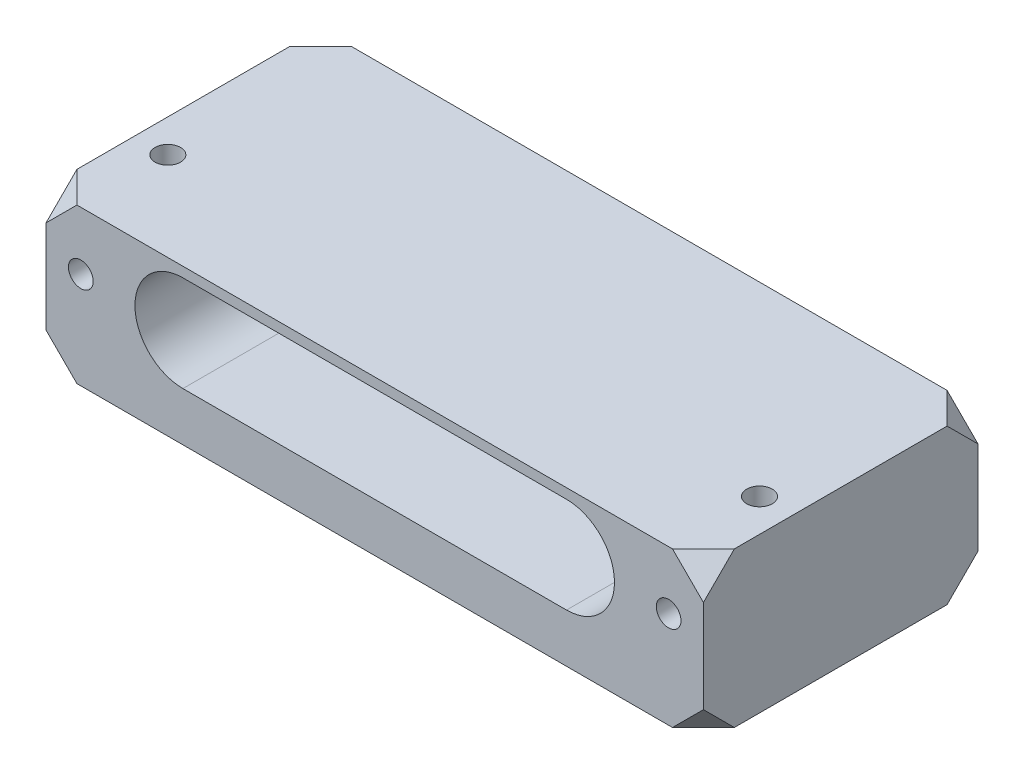
ISO-10303-21;
HEADER;
FILE_DESCRIPTION(('STEP AP214'),'2;1');
FILE_NAME('part.step','',(''),(''),'','','');
FILE_SCHEMA(('AUTOMOTIVE_DESIGN { 1 0 10303 214 1 1 1 1 }'));
ENDSEC;
DATA;
#1=APPLICATION_CONTEXT('core data for automotive mechanical design processes');
#2=APPLICATION_PROTOCOL_DEFINITION('international standard','automotive_design',2000,#1);
#3=PRODUCT_CONTEXT('',#1,'mechanical');
#4=PRODUCT('Part','Part','',(#3));
#5=PRODUCT_RELATED_PRODUCT_CATEGORY('part','',(#4));
#6=PRODUCT_DEFINITION_FORMATION('','',#4);
#7=PRODUCT_DEFINITION_CONTEXT('part definition',#1,'design');
#8=PRODUCT_DEFINITION('design','',#6,#7);
#9=PRODUCT_DEFINITION_SHAPE('','',#8);
#10=(LENGTH_UNIT() NAMED_UNIT(*) SI_UNIT(.MILLI.,.METRE.));
#11=(NAMED_UNIT(*) PLANE_ANGLE_UNIT() SI_UNIT($,.RADIAN.));
#12=(NAMED_UNIT(*) SI_UNIT($,.STERADIAN.) SOLID_ANGLE_UNIT());
#13=UNCERTAINTY_MEASURE_WITH_UNIT(LENGTH_MEASURE(1.E-05),#10,'distance_accuracy_value','');
#14=(GEOMETRIC_REPRESENTATION_CONTEXT(3) GLOBAL_UNCERTAINTY_ASSIGNED_CONTEXT((#13)) GLOBAL_UNIT_ASSIGNED_CONTEXT((#10,
#11,#12)) REPRESENTATION_CONTEXT('',''));
#15=CARTESIAN_POINT('',(0.,0.,0.));
#16=DIRECTION('',(0.,0.,1.));
#17=DIRECTION('',(1.,0.,0.));
#18=AXIS2_PLACEMENT_3D('',#15,#16,#17);
#19=CARTESIAN_POINT('',(0.,105.914201387198,-35.5));
#20=DIRECTION('',(0.,0.,-1.));
#21=DIRECTION('',(-1.,0.,0.));
#22=AXIS2_PLACEMENT_3D('',#19,#20,#21);
#23=PLANE('',#22);
#24=DIRECTION('',(-1.,0.,0.));
#25=VECTOR('',#24,1.);
#26=CARTESIAN_POINT('',(0.,20.,-35.5));
#27=LINE('',#26,#25);
#28=CARTESIAN_POINT('',(81.,20.,-35.5));
#29=VERTEX_POINT('',#28);
#30=CARTESIAN_POINT('',(3.99999999999999,20.,-35.5));
#31=VERTEX_POINT('',#30);
#32=EDGE_CURVE('E234',#29,#31,#27,.T.);
#33=ORIENTED_EDGE('',*,*,#32,.F.);
#34=DIRECTION('',(0.707106781186547,-0.707106781186547,0.));
#35=VECTOR('',#34,1.);
#36=CARTESIAN_POINT('',(-2.45710069359897,103.457100693599,-35.5));
#37=LINE('',#36,#35);
#38=CARTESIAN_POINT('',(85.,16.,-35.5));
#39=VERTEX_POINT('',#38);
#40=EDGE_CURVE('E238',#29,#39,#37,.T.);
#41=ORIENTED_EDGE('',*,*,#40,.T.);
#42=DIRECTION('',(0.,-1.,0.));
#43=VECTOR('',#42,1.);
#44=CARTESIAN_POINT('',(85.,105.914201387198,-35.5));
#45=LINE('',#44,#43);
#46=CARTESIAN_POINT('',(85.,4.00000000000004,-35.5));
#47=VERTEX_POINT('',#46);
#48=EDGE_CURVE('E226',#39,#47,#45,.T.);
#49=ORIENTED_EDGE('',*,*,#48,.T.);
#50=DIRECTION('',(-0.707106781186548,-0.707106781186547,0.));
#51=VECTOR('',#50,1.);
#52=CARTESIAN_POINT('',(93.4571006935989,12.457100693599,-35.5));
#53=LINE('',#52,#51);
#54=CARTESIAN_POINT('',(81.,0.,-35.5));
#55=VERTEX_POINT('',#54);
#56=EDGE_CURVE('E252',#47,#55,#53,.T.);
#57=ORIENTED_EDGE('',*,*,#56,.T.);
#58=DIRECTION('',(1.,0.,0.));
#59=VECTOR('',#58,1.);
#60=CARTESIAN_POINT('',(0.,0.,-35.5));
#61=LINE('',#60,#59);
#62=CARTESIAN_POINT('',(4.,0.,-35.5));
#63=VERTEX_POINT('',#62);
#64=EDGE_CURVE('E372',#63,#55,#61,.T.);
#65=ORIENTED_EDGE('',*,*,#64,.F.);
#66=DIRECTION('',(-0.707106781186548,0.707106781186548,0.));
#67=VECTOR('',#66,1.);
#68=CARTESIAN_POINT('',(-50.957100693599,54.957100693599,-35.5));
#69=LINE('',#68,#67);
#70=CARTESIAN_POINT('',(0.,4.00000000000002,-35.5));
#71=VERTEX_POINT('',#70);
#72=EDGE_CURVE('E266',#63,#71,#69,.T.);
#73=ORIENTED_EDGE('',*,*,#72,.T.);
#74=DIRECTION('',(0.,-1.,0.));
#75=VECTOR('',#74,1.);
#76=CARTESIAN_POINT('',(0.,105.914201387198,-35.5));
#77=LINE('',#76,#75);
#78=CARTESIAN_POINT('',(0.,16.,-35.5));
#79=VERTEX_POINT('',#78);
#80=EDGE_CURVE('E235',#79,#71,#77,.T.);
#81=ORIENTED_EDGE('',*,*,#80,.F.);
#82=DIRECTION('',(0.707106781186547,0.707106781186548,0.));
#83=VECTOR('',#82,1.);
#84=CARTESIAN_POINT('',(44.957100693599,60.957100693599,-35.5));
#85=LINE('',#84,#83);
#86=EDGE_CURVE('E263',#79,#31,#85,.T.);
#87=ORIENTED_EDGE('',*,*,#86,.T.);
#88=EDGE_LOOP('',(#33,#41,#49,#57,#65,#73,#81,#87));
#89=FACE_BOUND('',#88,.T.);
#90=ADVANCED_FACE('F45',(#89),#23,.T.);
#91=CARTESIAN_POINT('',(0.,0.,0.));
#92=DIRECTION('',(0.,-1.,0.));
#93=DIRECTION('',(0.,0.,-1.));
#94=AXIS2_PLACEMENT_3D('',#91,#92,#93);
#95=PLANE('',#94);
#96=DIRECTION('',(0.866025403784439,0.,-0.5));
#97=VECTOR('',#96,1.);
#98=CARTESIAN_POINT('',(1.3,0.,-13.2031832941094));
#99=LINE('',#98,#97);
#100=CARTESIAN_POINT('',(1.3,0.,-13.2031832941094));
#101=VERTEX_POINT('',#100);
#102=CARTESIAN_POINT('',(4.25,0.,-14.9063665882188));
#103=VERTEX_POINT('',#102);
#104=EDGE_CURVE('E449',#101,#103,#99,.T.);
#105=ORIENTED_EDGE('',*,*,#104,.F.);
#106=DIRECTION('',(0.,0.,-1.));
#107=VECTOR('',#106,1.);
#108=CARTESIAN_POINT('',(1.3,0.,-9.7968167058906));
#109=LINE('',#108,#107);
#110=CARTESIAN_POINT('',(1.3,0.,-9.7968167058906));
#111=VERTEX_POINT('',#110);
#112=EDGE_CURVE('E507',#111,#101,#109,.T.);
#113=ORIENTED_EDGE('',*,*,#112,.F.);
#114=DIRECTION('',(-0.866025403784438,0.,-0.5));
#115=VECTOR('',#114,1.);
#116=CARTESIAN_POINT('',(4.25,0.,-8.09363341178121));
#117=LINE('',#116,#115);
#118=CARTESIAN_POINT('',(4.25,0.,-8.09363341178121));
#119=VERTEX_POINT('',#118);
#120=EDGE_CURVE('E512',#119,#111,#117,.T.);
#121=ORIENTED_EDGE('',*,*,#120,.F.);
#122=DIRECTION('',(-0.866025403784439,0.,0.5));
#123=VECTOR('',#122,1.);
#124=CARTESIAN_POINT('',(7.2,0.,-9.7968167058906));
#125=LINE('',#124,#123);
#126=CARTESIAN_POINT('',(7.2,0.,-9.7968167058906));
#127=VERTEX_POINT('',#126);
#128=EDGE_CURVE('E516',#127,#119,#125,.T.);
#129=ORIENTED_EDGE('',*,*,#128,.F.);
#130=DIRECTION('',(0.,0.,1.));
#131=VECTOR('',#130,1.);
#132=CARTESIAN_POINT('',(7.2,0.,-13.2031832941094));
#133=LINE('',#132,#131);
#134=CARTESIAN_POINT('',(7.2,0.,-13.2031832941094));
#135=VERTEX_POINT('',#134);
#136=EDGE_CURVE('E520',#135,#127,#133,.T.);
#137=ORIENTED_EDGE('',*,*,#136,.F.);
#138=DIRECTION('',(0.866025403784439,0.,0.5));
#139=VECTOR('',#138,1.);
#140=CARTESIAN_POINT('',(4.25,0.,-14.9063665882188));
#141=LINE('',#140,#139);
#142=EDGE_CURVE('E524',#103,#135,#141,.T.);
#143=ORIENTED_EDGE('',*,*,#142,.F.);
#144=EDGE_LOOP('',(#105,#113,#121,#129,#137,#143));
#145=FACE_BOUND('',#144,.T.);
#146=DIRECTION('',(0.866025403784439,0.,-0.5));
#147=VECTOR('',#146,1.);
#148=CARTESIAN_POINT('',(77.8,0.,-13.2031832941094));
#149=LINE('',#148,#147);
#150=CARTESIAN_POINT('',(77.8,0.,-13.2031832941094));
#151=VERTEX_POINT('',#150);
#152=CARTESIAN_POINT('',(80.75,0.,-14.9063665882188));
#153=VERTEX_POINT('',#152);
#154=EDGE_CURVE('E446',#151,#153,#149,.T.);
#155=ORIENTED_EDGE('',*,*,#154,.F.);
#156=DIRECTION('',(0.,0.,-1.));
#157=VECTOR('',#156,1.);
#158=CARTESIAN_POINT('',(77.8,0.,-9.7968167058906));
#159=LINE('',#158,#157);
#160=CARTESIAN_POINT('',(77.8,0.,-9.7968167058906));
#161=VERTEX_POINT('',#160);
#162=EDGE_CURVE('E424',#161,#151,#159,.T.);
#163=ORIENTED_EDGE('',*,*,#162,.F.);
#164=DIRECTION('',(-0.866025403784439,0.,-0.499999999999999));
#165=VECTOR('',#164,1.);
#166=CARTESIAN_POINT('',(80.75,0.,-8.09363341178121));
#167=LINE('',#166,#165);
#168=CARTESIAN_POINT('',(80.75,0.,-8.09363341178121));
#169=VERTEX_POINT('',#168);
#170=EDGE_CURVE('E462',#169,#161,#167,.T.);
#171=ORIENTED_EDGE('',*,*,#170,.F.);
#172=DIRECTION('',(-0.866025403784438,0.,0.500000000000001));
#173=VECTOR('',#172,1.);
#174=CARTESIAN_POINT('',(83.7,0.,-9.79681670589062));
#175=LINE('',#174,#173);
#176=CARTESIAN_POINT('',(83.7,0.,-9.79681670589062));
#177=VERTEX_POINT('',#176);
#178=EDGE_CURVE('E458',#177,#169,#175,.T.);
#179=ORIENTED_EDGE('',*,*,#178,.F.);
#180=DIRECTION('',(0.,0.,1.));
#181=VECTOR('',#180,1.);
#182=CARTESIAN_POINT('',(83.7,0.,-13.2031832941094));
#183=LINE('',#182,#181);
#184=CARTESIAN_POINT('',(83.7,0.,-13.2031832941094));
#185=VERTEX_POINT('',#184);
#186=EDGE_CURVE('E454',#185,#177,#183,.T.);
#187=ORIENTED_EDGE('',*,*,#186,.F.);
#188=DIRECTION('',(0.866025403784438,0.,0.500000000000001));
#189=VECTOR('',#188,1.);
#190=CARTESIAN_POINT('',(80.75,0.,-14.9063665882188));
#191=LINE('',#190,#189);
#192=EDGE_CURVE('E450',#153,#185,#191,.T.);
#193=ORIENTED_EDGE('',*,*,#192,.F.);
#194=EDGE_LOOP('',(#155,#163,#171,#179,#187,#193));
#195=FACE_BOUND('',#194,.T.);
#196=ORIENTED_EDGE('',*,*,#64,.T.);
#197=DIRECTION('',(0.707106781186548,0.,0.707106781186548));
#198=VECTOR('',#197,1.);
#199=CARTESIAN_POINT('',(58.25,0.,-58.25));
#200=LINE('',#199,#198);
#201=CARTESIAN_POINT('',(85.,0.,-31.5));
#202=VERTEX_POINT('',#201);
#203=EDGE_CURVE('E248',#55,#202,#200,.T.);
#204=ORIENTED_EDGE('',*,*,#203,.T.);
#205=DIRECTION('',(0.,0.,-1.));
#206=VECTOR('',#205,1.);
#207=CARTESIAN_POINT('',(85.,0.,0.));
#208=LINE('',#207,#206);
#209=CARTESIAN_POINT('',(85.,0.,-4.));
#210=VERTEX_POINT('',#209);
#211=EDGE_CURVE('E342',#210,#202,#208,.T.);
#212=ORIENTED_EDGE('',*,*,#211,.F.);
#213=DIRECTION('',(-0.707106781186548,0.,0.707106781186547));
#214=VECTOR('',#213,1.);
#215=CARTESIAN_POINT('',(40.5,0.,40.5));
#216=LINE('',#215,#214);
#217=CARTESIAN_POINT('',(81.,0.,0.));
#218=VERTEX_POINT('',#217);
#219=EDGE_CURVE('E310',#210,#218,#216,.T.);
#220=ORIENTED_EDGE('',*,*,#219,.T.);
#221=DIRECTION('',(1.,0.,0.));
#222=VECTOR('',#221,1.);
#223=CARTESIAN_POINT('',(0.,0.,0.));
#224=LINE('',#223,#222);
#225=CARTESIAN_POINT('',(4.,0.,0.));
#226=VERTEX_POINT('',#225);
#227=EDGE_CURVE('E346',#226,#218,#224,.T.);
#228=ORIENTED_EDGE('',*,*,#227,.F.);
#229=DIRECTION('',(-0.707106781186548,0.,-0.707106781186547));
#230=VECTOR('',#229,1.);
#231=CARTESIAN_POINT('',(2.,0.,-2.));
#232=LINE('',#231,#230);
#233=CARTESIAN_POINT('',(0.,0.,-4.));
#234=VERTEX_POINT('',#233);
#235=EDGE_CURVE('E321',#226,#234,#232,.T.);
#236=ORIENTED_EDGE('',*,*,#235,.T.);
#237=DIRECTION('',(0.,0.,1.));
#238=VECTOR('',#237,1.);
#239=CARTESIAN_POINT('',(0.,0.,0.));
#240=LINE('',#239,#238);
#241=CARTESIAN_POINT('',(0.,0.,-31.5));
#242=VERTEX_POINT('',#241);
#243=EDGE_CURVE('E350',#242,#234,#240,.T.);
#244=ORIENTED_EDGE('',*,*,#243,.F.);
#245=DIRECTION('',(0.707106781186547,0.,-0.707106781186548));
#246=VECTOR('',#245,1.);
#247=CARTESIAN_POINT('',(-15.75,0.,-15.75));
#248=LINE('',#247,#246);
#249=EDGE_CURVE('E274',#242,#63,#248,.T.);
#250=ORIENTED_EDGE('',*,*,#249,.T.);
#251=EDGE_LOOP('',(#196,#204,#212,#220,#228,#236,#244,#250));
#252=FACE_BOUND('',#251,.T.);
#253=ADVANCED_FACE('F611',(#145,#195,#252),#95,.T.);
#254=CARTESIAN_POINT('',(4.25,20.,-11.5));
#255=DIRECTION('',(0.,-1.,0.));
#256=DIRECTION('',(0.,0.,-1.));
#257=AXIS2_PLACEMENT_3D('',#254,#255,#256);
#258=CYLINDRICAL_SURFACE('',#257,1.65);
#259=CARTESIAN_POINT('',(4.25,20.,-11.5));
#260=DIRECTION('',(0.,1.,0.));
#261=DIRECTION('',(0.,0.,1.));
#262=AXIS2_PLACEMENT_3D('',#259,#260,#261);
#263=CIRCLE('',#262,1.65);
#264=CARTESIAN_POINT('',(4.25,20.,-9.85));
#265=VERTEX_POINT('',#264);
#266=EDGE_CURVE('E353',#265,#265,#263,.T.);
#267=ORIENTED_EDGE('',*,*,#266,.T.);
#268=EDGE_LOOP('',(#267));
#269=FACE_BOUND('',#268,.T.);
#270=CARTESIAN_POINT('',(4.25,7.,-11.5));
#271=DIRECTION('',(0.,-1.,0.));
#272=DIRECTION('',(0.,0.,-1.));
#273=AXIS2_PLACEMENT_3D('',#270,#271,#272);
#274=CIRCLE('',#273,1.65);
#275=CARTESIAN_POINT('',(4.25,7.,-13.15));
#276=VERTEX_POINT('',#275);
#277=EDGE_CURVE('E326',#276,#276,#274,.T.);
#278=ORIENTED_EDGE('',*,*,#277,.T.);
#279=EDGE_LOOP('',(#278));
#280=FACE_BOUND('',#279,.T.);
#281=ADVANCED_FACE('F615',(#269,#280),#258,.F.);
#282=CARTESIAN_POINT('',(80.75,20.,-11.5));
#283=DIRECTION('',(0.,-1.,0.));
#284=DIRECTION('',(0.,0.,-1.));
#285=AXIS2_PLACEMENT_3D('',#282,#283,#284);
#286=CYLINDRICAL_SURFACE('',#285,1.65);
#287=CARTESIAN_POINT('',(80.75,20.,-11.5));
#288=DIRECTION('',(0.,1.,0.));
#289=DIRECTION('',(0.,0.,1.));
#290=AXIS2_PLACEMENT_3D('',#287,#288,#289);
#291=CIRCLE('',#290,1.65);
#292=CARTESIAN_POINT('',(80.75,20.,-9.85));
#293=VERTEX_POINT('',#292);
#294=EDGE_CURVE('E365',#293,#293,#291,.T.);
#295=ORIENTED_EDGE('',*,*,#294,.T.);
#296=EDGE_LOOP('',(#295));
#297=FACE_BOUND('',#296,.T.);
#298=CARTESIAN_POINT('',(80.75,7.,-11.5));
#299=DIRECTION('',(0.,-1.,0.));
#300=DIRECTION('',(0.,0.,-1.));
#301=AXIS2_PLACEMENT_3D('',#298,#299,#300);
#302=CIRCLE('',#301,1.65);
#303=CARTESIAN_POINT('',(80.75,7.,-13.15));
#304=VERTEX_POINT('',#303);
#305=EDGE_CURVE('E331',#304,#304,#302,.T.);
#306=ORIENTED_EDGE('',*,*,#305,.T.);
#307=EDGE_LOOP('',(#306));
#308=FACE_BOUND('',#307,.T.);
#309=ADVANCED_FACE('F619',(#297,#308),#286,.F.);
#310=CARTESIAN_POINT('',(0.,20.,0.));
#311=DIRECTION('',(0.,-1.,0.));
#312=DIRECTION('',(0.,0.,-1.));
#313=AXIS2_PLACEMENT_3D('',#310,#311,#312);
#314=PLANE('',#313);
#315=DIRECTION('',(0.707106781186547,0.,0.707106781186547));
#316=VECTOR('',#315,1.);
#317=CARTESIAN_POINT('',(58.25,20.,-58.25));
#318=LINE('',#317,#316);
#319=CARTESIAN_POINT('',(85.,20.,-31.5));
#320=VERTEX_POINT('',#319);
#321=EDGE_CURVE('E54',#29,#320,#318,.T.);
#322=ORIENTED_EDGE('',*,*,#321,.F.);
#323=ORIENTED_EDGE('',*,*,#32,.T.);
#324=DIRECTION('',(0.707106781186547,0.,-0.707106781186548));
#325=VECTOR('',#324,1.);
#326=CARTESIAN_POINT('',(-15.75,20.,-15.75));
#327=LINE('',#326,#325);
#328=CARTESIAN_POINT('',(0.,20.,-31.5));
#329=VERTEX_POINT('',#328);
#330=EDGE_CURVE('E259',#329,#31,#327,.T.);
#331=ORIENTED_EDGE('',*,*,#330,.F.);
#332=DIRECTION('',(0.,0.,1.));
#333=VECTOR('',#332,1.);
#334=CARTESIAN_POINT('',(0.,20.,0.));
#335=LINE('',#334,#333);
#336=CARTESIAN_POINT('',(0.,20.,-4.));
#337=VERTEX_POINT('',#336);
#338=EDGE_CURVE('E345',#329,#337,#335,.T.);
#339=ORIENTED_EDGE('',*,*,#338,.T.);
#340=DIRECTION('',(-0.707106781186548,0.,-0.707106781186547));
#341=VECTOR('',#340,1.);
#342=CARTESIAN_POINT('',(2.,20.,-2.));
#343=LINE('',#342,#341);
#344=CARTESIAN_POINT('',(4.,20.,0.));
#345=VERTEX_POINT('',#344);
#346=EDGE_CURVE('E298',#345,#337,#343,.T.);
#347=ORIENTED_EDGE('',*,*,#346,.F.);
#348=DIRECTION('',(1.,0.,0.));
#349=VECTOR('',#348,1.);
#350=CARTESIAN_POINT('',(0.,20.,0.));
#351=LINE('',#350,#349);
#352=CARTESIAN_POINT('',(81.,20.,0.));
#353=VERTEX_POINT('',#352);
#354=EDGE_CURVE('E356',#345,#353,#351,.T.);
#355=ORIENTED_EDGE('',*,*,#354,.T.);
#356=DIRECTION('',(-0.707106781186548,0.,0.707106781186547));
#357=VECTOR('',#356,1.);
#358=CARTESIAN_POINT('',(40.5,20.,40.5));
#359=LINE('',#358,#357);
#360=CARTESIAN_POINT('',(85.,20.,-4.00000000000003));
#361=VERTEX_POINT('',#360);
#362=EDGE_CURVE('E286',#361,#353,#359,.T.);
#363=ORIENTED_EDGE('',*,*,#362,.F.);
#364=DIRECTION('',(0.,0.,-1.));
#365=VECTOR('',#364,1.);
#366=CARTESIAN_POINT('',(85.,20.,0.));
#367=LINE('',#366,#365);
#368=EDGE_CURVE('E341',#361,#320,#367,.T.);
#369=ORIENTED_EDGE('',*,*,#368,.T.);
#370=EDGE_LOOP('',(#322,#323,#331,#339,#347,#355,#363,#369));
#371=FACE_BOUND('',#370,.T.);
#372=ORIENTED_EDGE('',*,*,#266,.F.);
#373=EDGE_LOOP('',(#372));
#374=FACE_BOUND('',#373,.T.);
#375=ORIENTED_EDGE('',*,*,#294,.F.);
#376=EDGE_LOOP('',(#375));
#377=FACE_BOUND('',#376,.T.);
#378=ADVANCED_FACE('F622',(#371,#374,#377),#314,.F.);
#379=CARTESIAN_POINT('',(0.,20.,0.));
#380=DIRECTION('',(1.,0.,0.));
#381=DIRECTION('',(0.,0.,-1.));
#382=AXIS2_PLACEMENT_3D('',#379,#380,#381);
#383=PLANE('',#382);
#384=DIRECTION('',(0.,0.707106781186548,0.707106781186548));
#385=VECTOR('',#384,1.);
#386=CARTESIAN_POINT('',(0.,35.75,-15.75));
#387=LINE('',#386,#385);
#388=EDGE_CURVE('E255',#79,#329,#387,.T.);
#389=ORIENTED_EDGE('',*,*,#388,.F.);
#390=ORIENTED_EDGE('',*,*,#80,.T.);
#391=DIRECTION('',(0.,0.707106781186547,-0.707106781186548));
#392=VECTOR('',#391,1.);
#393=CARTESIAN_POINT('',(0.,-5.74999999999999,-25.75));
#394=LINE('',#393,#392);
#395=EDGE_CURVE('E270',#242,#71,#394,.T.);
#396=ORIENTED_EDGE('',*,*,#395,.F.);
#397=ORIENTED_EDGE('',*,*,#243,.T.);
#398=DIRECTION('',(0.,-0.707106781186548,-0.707106781186547));
#399=VECTOR('',#398,1.);
#400=CARTESIAN_POINT('',(0.,12.,8.));
#401=LINE('',#400,#399);
#402=CARTESIAN_POINT('',(0.,4.,0.));
#403=VERTEX_POINT('',#402);
#404=EDGE_CURVE('E317',#403,#234,#401,.T.);
#405=ORIENTED_EDGE('',*,*,#404,.F.);
#406=DIRECTION('',(0.,-1.,0.));
#407=VECTOR('',#406,1.);
#408=CARTESIAN_POINT('',(0.,20.,0.));
#409=LINE('',#408,#407);
#410=CARTESIAN_POINT('',(0.,16.,0.));
#411=VERTEX_POINT('',#410);
#412=EDGE_CURVE('E325',#411,#403,#409,.T.);
#413=ORIENTED_EDGE('',*,*,#412,.F.);
#414=DIRECTION('',(0.,-0.707106781186548,0.707106781186547));
#415=VECTOR('',#414,1.);
#416=CARTESIAN_POINT('',(0.,18.,-2.));
#417=LINE('',#416,#415);
#418=EDGE_CURVE('E294',#337,#411,#417,.T.);
#419=ORIENTED_EDGE('',*,*,#418,.F.);
#420=ORIENTED_EDGE('',*,*,#338,.F.);
#421=EDGE_LOOP('',(#389,#390,#396,#397,#405,#413,#419,#420));
#422=FACE_BOUND('',#421,.T.);
#423=ADVANCED_FACE('F47',(#422),#383,.F.);
#424=CARTESIAN_POINT('',(0.,20.,0.));
#425=DIRECTION('',(0.,0.,-1.));
#426=DIRECTION('',(-1.,0.,0.));
#427=AXIS2_PLACEMENT_3D('',#424,#425,#426);
#428=PLANE('',#427);
#429=DIRECTION('',(0.707106781186548,-0.707106781186548,0.));
#430=VECTOR('',#429,1.);
#431=CARTESIAN_POINT('',(40.5,60.5,0.));
#432=LINE('',#431,#430);
#433=CARTESIAN_POINT('',(85.,16.,0.));
#434=VERTEX_POINT('',#433);
#435=EDGE_CURVE('E282',#353,#434,#432,.T.);
#436=ORIENTED_EDGE('',*,*,#435,.F.);
#437=ORIENTED_EDGE('',*,*,#354,.F.);
#438=DIRECTION('',(0.707106781186547,0.707106781186548,0.));
#439=VECTOR('',#438,1.);
#440=CARTESIAN_POINT('',(2.,18.,0.));
#441=LINE('',#440,#439);
#442=EDGE_CURVE('E290',#411,#345,#441,.T.);
#443=ORIENTED_EDGE('',*,*,#442,.F.);
#444=ORIENTED_EDGE('',*,*,#412,.T.);
#445=DIRECTION('',(-0.707106781186547,0.707106781186548,0.));
#446=VECTOR('',#445,1.);
#447=CARTESIAN_POINT('',(-8.,12.,0.));
#448=LINE('',#447,#446);
#449=EDGE_CURVE('E313',#226,#403,#448,.T.);
#450=ORIENTED_EDGE('',*,*,#449,.F.);
#451=ORIENTED_EDGE('',*,*,#227,.T.);
#452=DIRECTION('',(-0.707106781186548,-0.707106781186547,0.));
#453=VECTOR('',#452,1.);
#454=CARTESIAN_POINT('',(50.5,-30.5,0.));
#455=LINE('',#454,#453);
#456=CARTESIAN_POINT('',(85.,4.,0.));
#457=VERTEX_POINT('',#456);
#458=EDGE_CURVE('E306',#457,#218,#455,.T.);
#459=ORIENTED_EDGE('',*,*,#458,.F.);
#460=DIRECTION('',(0.,-1.,0.));
#461=VECTOR('',#460,1.);
#462=CARTESIAN_POINT('',(85.,20.,0.));
#463=LINE('',#462,#461);
#464=EDGE_CURVE('E338',#434,#457,#463,.T.);
#465=ORIENTED_EDGE('',*,*,#464,.F.);
#466=EDGE_LOOP('',(#436,#437,#443,#444,#450,#451,#459,#465));
#467=FACE_BOUND('',#466,.T.);
#468=CARTESIAN_POINT('',(80.5,12.5,0.));
#469=DIRECTION('',(0.,0.,1.));
#470=DIRECTION('',(1.,0.,0.));
#471=AXIS2_PLACEMENT_3D('',#468,#469,#470);
#472=CIRCLE('',#471,1.6);
#473=CARTESIAN_POINT('',(82.1,12.5,0.));
#474=VERTEX_POINT('',#473);
#475=EDGE_CURVE('E560',#474,#474,#472,.T.);
#476=ORIENTED_EDGE('',*,*,#475,.F.);
#477=EDGE_LOOP('',(#476));
#478=FACE_BOUND('',#477,.T.);
#479=CARTESIAN_POINT('',(4.5,12.5,0.));
#480=DIRECTION('',(0.,0.,1.));
#481=DIRECTION('',(1.,0.,0.));
#482=AXIS2_PLACEMENT_3D('',#479,#480,#481);
#483=CIRCLE('',#482,1.6);
#484=CARTESIAN_POINT('',(6.1,12.5,0.));
#485=VERTEX_POINT('',#484);
#486=EDGE_CURVE('E556',#485,#485,#483,.T.);
#487=ORIENTED_EDGE('',*,*,#486,.F.);
#488=EDGE_LOOP('',(#487));
#489=FACE_BOUND('',#488,.T.);
#490=CARTESIAN_POINT('',(67.3,12.5,0.));
#491=DIRECTION('',(0.,0.,1.));
#492=DIRECTION('',(1.,0.,0.));
#493=AXIS2_PLACEMENT_3D('',#490,#491,#492);
#494=CIRCLE('',#493,6.2);
#495=CARTESIAN_POINT('',(67.3,6.3,0.));
#496=VERTEX_POINT('',#495);
#497=CARTESIAN_POINT('',(67.3,18.7,0.));
#498=VERTEX_POINT('',#497);
#499=EDGE_CURVE('E414',#496,#498,#494,.T.);
#500=ORIENTED_EDGE('',*,*,#499,.F.);
#501=DIRECTION('',(1.,0.,0.));
#502=VECTOR('',#501,1.);
#503=CARTESIAN_POINT('',(67.3,6.3,0.));
#504=LINE('',#503,#502);
#505=CARTESIAN_POINT('',(17.7,6.3,0.));
#506=VERTEX_POINT('',#505);
#507=EDGE_CURVE('E410',#506,#496,#504,.T.);
#508=ORIENTED_EDGE('',*,*,#507,.F.);
#509=CARTESIAN_POINT('',(17.7,12.5,0.));
#510=DIRECTION('',(0.,0.,1.));
#511=DIRECTION('',(1.,0.,0.));
#512=AXIS2_PLACEMENT_3D('',#509,#510,#511);
#513=CIRCLE('',#512,6.2);
#514=CARTESIAN_POINT('',(17.7,18.7,0.));
#515=VERTEX_POINT('',#514);
#516=EDGE_CURVE('E330',#515,#506,#513,.T.);
#517=ORIENTED_EDGE('',*,*,#516,.F.);
#518=DIRECTION('',(-1.,0.,0.));
#519=VECTOR('',#518,1.);
#520=CARTESIAN_POINT('',(17.7,18.7,0.));
#521=LINE('',#520,#519);
#522=EDGE_CURVE('E406',#498,#515,#521,.T.);
#523=ORIENTED_EDGE('',*,*,#522,.F.);
#524=EDGE_LOOP('',(#500,#508,#517,#523));
#525=FACE_BOUND('',#524,.T.);
#526=ADVANCED_FACE('F577',(#467,#478,#489,#525),#428,.F.);
#527=CARTESIAN_POINT('',(85.,20.,0.));
#528=DIRECTION('',(-1.,0.,0.));
#529=DIRECTION('',(0.,0.,1.));
#530=AXIS2_PLACEMENT_3D('',#527,#528,#529);
#531=PLANE('',#530);
#532=DIRECTION('',(0.,-0.707106781186547,-0.707106781186547));
#533=VECTOR('',#532,1.);
#534=CARTESIAN_POINT('',(85.,35.75,-15.75));
#535=LINE('',#534,#533);
#536=EDGE_CURVE('E12',#320,#39,#535,.T.);
#537=ORIENTED_EDGE('',*,*,#536,.F.);
#538=ORIENTED_EDGE('',*,*,#368,.F.);
#539=DIRECTION('',(0.,0.707106781186548,-0.707106781186547));
#540=VECTOR('',#539,1.);
#541=CARTESIAN_POINT('',(85.,18.,-2.00000000000002));
#542=LINE('',#541,#540);
#543=EDGE_CURVE('E278',#434,#361,#542,.T.);
#544=ORIENTED_EDGE('',*,*,#543,.F.);
#545=ORIENTED_EDGE('',*,*,#464,.T.);
#546=DIRECTION('',(0.,0.707106781186548,0.707106781186548));
#547=VECTOR('',#546,1.);
#548=CARTESIAN_POINT('',(85.,12.,8.));
#549=LINE('',#548,#547);
#550=EDGE_CURVE('E302',#210,#457,#549,.T.);
#551=ORIENTED_EDGE('',*,*,#550,.F.);
#552=ORIENTED_EDGE('',*,*,#211,.T.);
#553=DIRECTION('',(0.,-0.707106781186547,0.707106781186548));
#554=VECTOR('',#553,1.);
#555=CARTESIAN_POINT('',(85.,-5.74999999999999,-25.75));
#556=LINE('',#555,#554);
#557=EDGE_CURVE('E230',#47,#202,#556,.T.);
#558=ORIENTED_EDGE('',*,*,#557,.F.);
#559=ORIENTED_EDGE('',*,*,#48,.F.);
#560=EDGE_LOOP('',(#537,#538,#544,#545,#551,#552,#558,#559));
#561=FACE_BOUND('',#560,.T.);
#562=ADVANCED_FACE('F228',(#561),#531,.F.);
#563=CARTESIAN_POINT('',(0.,105.914201387198,-34.1));
#564=DIRECTION('',(0.,0.,-1.));
#565=DIRECTION('',(-1.,0.,0.));
#566=AXIS2_PLACEMENT_3D('',#563,#564,#565);
#567=PLANE('',#566);
#568=CARTESIAN_POINT('',(17.7,12.5,-34.1));
#569=DIRECTION('',(0.,0.,-1.));
#570=DIRECTION('',(-1.,0.,0.));
#571=AXIS2_PLACEMENT_3D('',#568,#569,#570);
#572=CIRCLE('',#571,6.2);
#573=CARTESIAN_POINT('',(17.7,18.7,-34.1));
#574=VERTEX_POINT('',#573);
#575=CARTESIAN_POINT('',(17.7,6.3,-34.1));
#576=VERTEX_POINT('',#575);
#577=EDGE_CURVE('E380',#574,#576,#572,.F.);
#578=ORIENTED_EDGE('',*,*,#577,.T.);
#579=DIRECTION('',(1.,0.,0.));
#580=VECTOR('',#579,1.);
#581=CARTESIAN_POINT('',(67.3,6.3,-34.1));
#582=LINE('',#581,#580);
#583=CARTESIAN_POINT('',(67.3,6.3,-34.1));
#584=VERTEX_POINT('',#583);
#585=EDGE_CURVE('E385',#576,#584,#582,.T.);
#586=ORIENTED_EDGE('',*,*,#585,.T.);
#587=CARTESIAN_POINT('',(67.3,12.5,-34.1));
#588=DIRECTION('',(0.,0.,-1.));
#589=DIRECTION('',(-1.,0.,0.));
#590=AXIS2_PLACEMENT_3D('',#587,#588,#589);
#591=CIRCLE('',#590,6.2);
#592=CARTESIAN_POINT('',(67.3,18.7,-34.1));
#593=VERTEX_POINT('',#592);
#594=EDGE_CURVE('E384',#584,#593,#591,.F.);
#595=ORIENTED_EDGE('',*,*,#594,.T.);
#596=DIRECTION('',(-1.,0.,0.));
#597=VECTOR('',#596,1.);
#598=CARTESIAN_POINT('',(17.7,18.7,-34.1));
#599=LINE('',#598,#597);
#600=EDGE_CURVE('E389',#593,#574,#599,.T.);
#601=ORIENTED_EDGE('',*,*,#600,.T.);
#602=EDGE_LOOP('',(#578,#586,#595,#601));
#603=FACE_BOUND('',#602,.T.);
#604=ADVANCED_FACE('F600',(#603),#567,.F.);
#605=CARTESIAN_POINT('',(67.3,6.3,-98.7278419685505));
#606=DIRECTION('',(0.,-1.,0.));
#607=DIRECTION('',(0.,0.,-1.));
#608=AXIS2_PLACEMENT_3D('',#605,#606,#607);
#609=PLANE('',#608);
#610=DIRECTION('',(0.,0.,1.));
#611=VECTOR('',#610,1.);
#612=CARTESIAN_POINT('',(17.7,6.3,-98.7278419685505));
#613=LINE('',#612,#611);
#614=EDGE_CURVE('E377',#576,#506,#613,.T.);
#615=ORIENTED_EDGE('',*,*,#614,.T.);
#616=ORIENTED_EDGE('',*,*,#507,.T.);
#617=DIRECTION('',(0.,0.,1.));
#618=VECTOR('',#617,1.);
#619=CARTESIAN_POINT('',(67.3,6.3,-98.7278419685505));
#620=LINE('',#619,#618);
#621=EDGE_CURVE('E381',#584,#496,#620,.T.);
#622=ORIENTED_EDGE('',*,*,#621,.F.);
#623=ORIENTED_EDGE('',*,*,#585,.F.);
#624=EDGE_LOOP('',(#615,#616,#622,#623));
#625=FACE_BOUND('',#624,.T.);
#626=ADVANCED_FACE('F592',(#625),#609,.F.);
#627=CARTESIAN_POINT('',(67.3,12.5,-98.7278419685505));
#628=DIRECTION('',(0.,0.,1.));
#629=DIRECTION('',(1.,0.,0.));
#630=AXIS2_PLACEMENT_3D('',#627,#628,#629);
#631=CYLINDRICAL_SURFACE('',#630,6.2);
#632=ORIENTED_EDGE('',*,*,#621,.T.);
#633=ORIENTED_EDGE('',*,*,#499,.T.);
#634=DIRECTION('',(0.,0.,1.));
#635=VECTOR('',#634,1.);
#636=CARTESIAN_POINT('',(67.3,18.7,-98.7278419685505));
#637=LINE('',#636,#635);
#638=EDGE_CURVE('E386',#593,#498,#637,.T.);
#639=ORIENTED_EDGE('',*,*,#638,.F.);
#640=ORIENTED_EDGE('',*,*,#594,.F.);
#641=EDGE_LOOP('',(#632,#633,#639,#640));
#642=FACE_BOUND('',#641,.T.);
#643=ADVANCED_FACE('F589',(#642),#631,.F.);
#644=CARTESIAN_POINT('',(17.7,18.7,-98.7278419685505));
#645=DIRECTION('',(0.,1.,0.));
#646=DIRECTION('',(0.,0.,1.));
#647=AXIS2_PLACEMENT_3D('',#644,#645,#646);
#648=PLANE('',#647);
#649=ORIENTED_EDGE('',*,*,#638,.T.);
#650=ORIENTED_EDGE('',*,*,#522,.T.);
#651=DIRECTION('',(0.,0.,1.));
#652=VECTOR('',#651,1.);
#653=CARTESIAN_POINT('',(17.7,18.7,-98.7278419685505));
#654=LINE('',#653,#652);
#655=EDGE_CURVE('E390',#574,#515,#654,.T.);
#656=ORIENTED_EDGE('',*,*,#655,.F.);
#657=ORIENTED_EDGE('',*,*,#600,.F.);
#658=EDGE_LOOP('',(#649,#650,#656,#657));
#659=FACE_BOUND('',#658,.T.);
#660=ADVANCED_FACE('F598',(#659),#648,.F.);
#661=CARTESIAN_POINT('',(17.7,12.5,-98.7278419685505));
#662=DIRECTION('',(0.,0.,1.));
#663=DIRECTION('',(1.,0.,0.));
#664=AXIS2_PLACEMENT_3D('',#661,#662,#663);
#665=CYLINDRICAL_SURFACE('',#664,6.2);
#666=ORIENTED_EDGE('',*,*,#655,.T.);
#667=ORIENTED_EDGE('',*,*,#516,.T.);
#668=ORIENTED_EDGE('',*,*,#614,.F.);
#669=ORIENTED_EDGE('',*,*,#577,.F.);
#670=EDGE_LOOP('',(#666,#667,#668,#669));
#671=FACE_BOUND('',#670,.T.);
#672=ADVANCED_FACE('F595',(#671),#665,.F.);
#673=CARTESIAN_POINT('',(77.8,7.,-13.2031832941094));
#674=DIRECTION('',(-0.5,0.,-0.866025403784439));
#675=DIRECTION('',(-0.866025403784439,0.,0.5));
#676=AXIS2_PLACEMENT_3D('',#673,#674,#675);
#677=PLANE('',#676);
#678=ORIENTED_EDGE('',*,*,#154,.T.);
#679=DIRECTION('',(0.,-1.,0.));
#680=VECTOR('',#679,1.);
#681=CARTESIAN_POINT('',(80.75,7.,-14.9063665882188));
#682=LINE('',#681,#680);
#683=CARTESIAN_POINT('',(80.75,7.,-14.9063665882188));
#684=VERTEX_POINT('',#683);
#685=EDGE_CURVE('E445',#684,#153,#682,.T.);
#686=ORIENTED_EDGE('',*,*,#685,.F.);
#687=DIRECTION('',(0.866025403784439,0.,-0.5));
#688=VECTOR('',#687,1.);
#689=CARTESIAN_POINT('',(77.8,7.,-13.2031832941094));
#690=LINE('',#689,#688);
#691=CARTESIAN_POINT('',(77.8,7.,-13.2031832941094));
#692=VERTEX_POINT('',#691);
#693=EDGE_CURVE('E420',#692,#684,#690,.T.);
#694=ORIENTED_EDGE('',*,*,#693,.F.);
#695=DIRECTION('',(0.,-1.,0.));
#696=VECTOR('',#695,1.);
#697=CARTESIAN_POINT('',(77.8,7.,-13.2031832941094));
#698=LINE('',#697,#696);
#699=EDGE_CURVE('E469',#692,#151,#698,.T.);
#700=ORIENTED_EDGE('',*,*,#699,.T.);
#701=EDGE_LOOP('',(#678,#686,#694,#700));
#702=FACE_BOUND('',#701,.T.);
#703=ADVANCED_FACE('F649',(#702),#677,.F.);
#704=CARTESIAN_POINT('',(77.8,7.,-9.7968167058906));
#705=DIRECTION('',(-1.,0.,0.));
#706=DIRECTION('',(0.,0.,1.));
#707=AXIS2_PLACEMENT_3D('',#704,#705,#706);
#708=PLANE('',#707);
#709=ORIENTED_EDGE('',*,*,#162,.T.);
#710=ORIENTED_EDGE('',*,*,#699,.F.);
#711=DIRECTION('',(0.,0.,-1.));
#712=VECTOR('',#711,1.);
#713=CARTESIAN_POINT('',(77.8,7.,-9.7968167058906));
#714=LINE('',#713,#712);
#715=CARTESIAN_POINT('',(77.8,7.,-9.7968167058906));
#716=VERTEX_POINT('',#715);
#717=EDGE_CURVE('E441',#716,#692,#714,.T.);
#718=ORIENTED_EDGE('',*,*,#717,.F.);
#719=DIRECTION('',(0.,-1.,0.));
#720=VECTOR('',#719,1.);
#721=CARTESIAN_POINT('',(77.8,7.,-9.7968167058906));
#722=LINE('',#721,#720);
#723=EDGE_CURVE('E472',#716,#161,#722,.T.);
#724=ORIENTED_EDGE('',*,*,#723,.T.);
#725=EDGE_LOOP('',(#709,#710,#718,#724));
#726=FACE_BOUND('',#725,.T.);
#727=ADVANCED_FACE('F667',(#726),#708,.F.);
#728=CARTESIAN_POINT('',(80.75,7.,-8.09363341178121));
#729=DIRECTION('',(-0.499999999999999,0.,0.866025403784439));
#730=DIRECTION('',(0.866025403784439,0.,0.499999999999999));
#731=AXIS2_PLACEMENT_3D('',#728,#729,#730);
#732=PLANE('',#731);
#733=ORIENTED_EDGE('',*,*,#170,.T.);
#734=ORIENTED_EDGE('',*,*,#723,.F.);
#735=DIRECTION('',(-0.866025403784439,0.,-0.499999999999999));
#736=VECTOR('',#735,1.);
#737=CARTESIAN_POINT('',(80.75,7.,-8.09363341178121));
#738=LINE('',#737,#736);
#739=CARTESIAN_POINT('',(80.75,7.,-8.09363341178121));
#740=VERTEX_POINT('',#739);
#741=EDGE_CURVE('E437',#740,#716,#738,.T.);
#742=ORIENTED_EDGE('',*,*,#741,.F.);
#743=DIRECTION('',(0.,-1.,0.));
#744=VECTOR('',#743,1.);
#745=CARTESIAN_POINT('',(80.75,7.,-8.09363341178121));
#746=LINE('',#745,#744);
#747=EDGE_CURVE('E476',#740,#169,#746,.T.);
#748=ORIENTED_EDGE('',*,*,#747,.T.);
#749=EDGE_LOOP('',(#733,#734,#742,#748));
#750=FACE_BOUND('',#749,.T.);
#751=ADVANCED_FACE('F664',(#750),#732,.F.);
#752=CARTESIAN_POINT('',(83.7,7.,-9.79681670589062));
#753=DIRECTION('',(0.5,0.,0.866025403784438));
#754=DIRECTION('',(0.866025403784438,0.,-0.5));
#755=AXIS2_PLACEMENT_3D('',#752,#753,#754);
#756=PLANE('',#755);
#757=ORIENTED_EDGE('',*,*,#178,.T.);
#758=ORIENTED_EDGE('',*,*,#747,.F.);
#759=DIRECTION('',(-0.866025403784438,0.,0.500000000000001));
#760=VECTOR('',#759,1.);
#761=CARTESIAN_POINT('',(83.7,7.,-9.79681670589062));
#762=LINE('',#761,#760);
#763=CARTESIAN_POINT('',(83.7,7.,-9.79681670589062));
#764=VERTEX_POINT('',#763);
#765=EDGE_CURVE('E433',#764,#740,#762,.T.);
#766=ORIENTED_EDGE('',*,*,#765,.F.);
#767=DIRECTION('',(0.,-1.,0.));
#768=VECTOR('',#767,1.);
#769=CARTESIAN_POINT('',(83.7,7.,-9.79681670589062));
#770=LINE('',#769,#768);
#771=EDGE_CURVE('E479',#764,#177,#770,.T.);
#772=ORIENTED_EDGE('',*,*,#771,.T.);
#773=EDGE_LOOP('',(#757,#758,#766,#772));
#774=FACE_BOUND('',#773,.T.);
#775=ADVANCED_FACE('F660',(#774),#756,.F.);
#776=CARTESIAN_POINT('',(83.7,7.,-13.2031832941094));
#777=DIRECTION('',(1.,0.,0.));
#778=DIRECTION('',(0.,0.,-1.));
#779=AXIS2_PLACEMENT_3D('',#776,#777,#778);
#780=PLANE('',#779);
#781=ORIENTED_EDGE('',*,*,#186,.T.);
#782=ORIENTED_EDGE('',*,*,#771,.F.);
#783=DIRECTION('',(0.,0.,1.));
#784=VECTOR('',#783,1.);
#785=CARTESIAN_POINT('',(83.7,7.,-13.2031832941094));
#786=LINE('',#785,#784);
#787=CARTESIAN_POINT('',(83.7,7.,-13.2031832941094));
#788=VERTEX_POINT('',#787);
#789=EDGE_CURVE('E429',#788,#764,#786,.T.);
#790=ORIENTED_EDGE('',*,*,#789,.F.);
#791=DIRECTION('',(0.,-1.,0.));
#792=VECTOR('',#791,1.);
#793=CARTESIAN_POINT('',(83.7,7.,-13.2031832941094));
#794=LINE('',#793,#792);
#795=EDGE_CURVE('E482',#788,#185,#794,.T.);
#796=ORIENTED_EDGE('',*,*,#795,.T.);
#797=EDGE_LOOP('',(#781,#782,#790,#796));
#798=FACE_BOUND('',#797,.T.);
#799=ADVANCED_FACE('F656',(#798),#780,.F.);
#800=CARTESIAN_POINT('',(80.75,7.,-14.9063665882188));
#801=DIRECTION('',(0.5,0.,-0.866025403784438));
#802=DIRECTION('',(-0.866025403784438,0.,-0.5));
#803=AXIS2_PLACEMENT_3D('',#800,#801,#802);
#804=PLANE('',#803);
#805=ORIENTED_EDGE('',*,*,#192,.T.);
#806=ORIENTED_EDGE('',*,*,#795,.F.);
#807=DIRECTION('',(0.866025403784438,0.,0.500000000000001));
#808=VECTOR('',#807,1.);
#809=CARTESIAN_POINT('',(80.75,7.,-14.9063665882188));
#810=LINE('',#809,#808);
#811=EDGE_CURVE('E425',#684,#788,#810,.T.);
#812=ORIENTED_EDGE('',*,*,#811,.F.);
#813=ORIENTED_EDGE('',*,*,#685,.T.);
#814=EDGE_LOOP('',(#805,#806,#812,#813));
#815=FACE_BOUND('',#814,.T.);
#816=ADVANCED_FACE('F643',(#815),#804,.F.);
#817=CARTESIAN_POINT('',(0.,7.,0.));
#818=DIRECTION('',(0.,-1.,0.));
#819=DIRECTION('',(0.,0.,-1.));
#820=AXIS2_PLACEMENT_3D('',#817,#818,#819);
#821=PLANE('',#820);
#822=ORIENTED_EDGE('',*,*,#305,.F.);
#823=EDGE_LOOP('',(#822));
#824=FACE_BOUND('',#823,.T.);
#825=ORIENTED_EDGE('',*,*,#693,.T.);
#826=ORIENTED_EDGE('',*,*,#811,.T.);
#827=ORIENTED_EDGE('',*,*,#789,.T.);
#828=ORIENTED_EDGE('',*,*,#765,.T.);
#829=ORIENTED_EDGE('',*,*,#741,.T.);
#830=ORIENTED_EDGE('',*,*,#717,.T.);
#831=EDGE_LOOP('',(#825,#826,#827,#828,#829,#830));
#832=FACE_BOUND('',#831,.T.);
#833=ADVANCED_FACE('F639',(#824,#832),#821,.T.);
#834=CARTESIAN_POINT('',(1.3,7.,-13.2031832941094));
#835=DIRECTION('',(-0.5,0.,-0.866025403784439));
#836=DIRECTION('',(-0.866025403784439,0.,0.5));
#837=AXIS2_PLACEMENT_3D('',#834,#835,#836);
#838=PLANE('',#837);
#839=ORIENTED_EDGE('',*,*,#104,.T.);
#840=DIRECTION('',(0.,-1.,0.));
#841=VECTOR('',#840,1.);
#842=CARTESIAN_POINT('',(4.25,7.,-14.9063665882188));
#843=LINE('',#842,#841);
#844=CARTESIAN_POINT('',(4.25,7.,-14.9063665882188));
#845=VERTEX_POINT('',#844);
#846=EDGE_CURVE('E488',#845,#103,#843,.T.);
#847=ORIENTED_EDGE('',*,*,#846,.F.);
#848=DIRECTION('',(0.866025403784439,0.,-0.5));
#849=VECTOR('',#848,1.);
#850=CARTESIAN_POINT('',(1.3,7.,-13.2031832941094));
#851=LINE('',#850,#849);
#852=CARTESIAN_POINT('',(1.3,7.,-13.2031832941094));
#853=VERTEX_POINT('',#852);
#854=EDGE_CURVE('E511',#853,#845,#851,.T.);
#855=ORIENTED_EDGE('',*,*,#854,.F.);
#856=DIRECTION('',(0.,-1.,0.));
#857=VECTOR('',#856,1.);
#858=CARTESIAN_POINT('',(1.3,7.,-13.2031832941094));
#859=LINE('',#858,#857);
#860=EDGE_CURVE('E335',#853,#101,#859,.T.);
#861=ORIENTED_EDGE('',*,*,#860,.T.);
#862=EDGE_LOOP('',(#839,#847,#855,#861));
#863=FACE_BOUND('',#862,.T.);
#864=ADVANCED_FACE('F642',(#863),#838,.F.);
#865=CARTESIAN_POINT('',(1.3,7.,-9.7968167058906));
#866=DIRECTION('',(-1.,0.,0.));
#867=DIRECTION('',(0.,0.,1.));
#868=AXIS2_PLACEMENT_3D('',#865,#866,#867);
#869=PLANE('',#868);
#870=ORIENTED_EDGE('',*,*,#112,.T.);
#871=ORIENTED_EDGE('',*,*,#860,.F.);
#872=DIRECTION('',(0.,0.,-1.));
#873=VECTOR('',#872,1.);
#874=CARTESIAN_POINT('',(1.3,7.,-9.7968167058906));
#875=LINE('',#874,#873);
#876=CARTESIAN_POINT('',(1.3,7.,-9.7968167058906));
#877=VERTEX_POINT('',#876);
#878=EDGE_CURVE('E493',#877,#853,#875,.T.);
#879=ORIENTED_EDGE('',*,*,#878,.F.);
#880=DIRECTION('',(0.,-1.,0.));
#881=VECTOR('',#880,1.);
#882=CARTESIAN_POINT('',(1.3,7.,-9.7968167058906));
#883=LINE('',#882,#881);
#884=EDGE_CURVE('E502',#877,#111,#883,.T.);
#885=ORIENTED_EDGE('',*,*,#884,.T.);
#886=EDGE_LOOP('',(#870,#871,#879,#885));
#887=FACE_BOUND('',#886,.T.);
#888=ADVANCED_FACE('F721',(#887),#869,.F.);
#889=CARTESIAN_POINT('',(4.25,7.,-8.09363341178121));
#890=DIRECTION('',(-0.5,0.,0.866025403784438));
#891=DIRECTION('',(0.866025403784439,0.,0.5));
#892=AXIS2_PLACEMENT_3D('',#889,#890,#891);
#893=PLANE('',#892);
#894=ORIENTED_EDGE('',*,*,#120,.T.);
#895=ORIENTED_EDGE('',*,*,#884,.F.);
#896=DIRECTION('',(-0.866025403784438,0.,-0.5));
#897=VECTOR('',#896,1.);
#898=CARTESIAN_POINT('',(4.25,7.,-8.09363341178121));
#899=LINE('',#898,#897);
#900=CARTESIAN_POINT('',(4.25,7.,-8.09363341178121));
#901=VERTEX_POINT('',#900);
#902=EDGE_CURVE('E533',#901,#877,#899,.T.);
#903=ORIENTED_EDGE('',*,*,#902,.F.);
#904=DIRECTION('',(0.,-1.,0.));
#905=VECTOR('',#904,1.);
#906=CARTESIAN_POINT('',(4.25,7.,-8.09363341178121));
#907=LINE('',#906,#905);
#908=EDGE_CURVE('E499',#901,#119,#907,.T.);
#909=ORIENTED_EDGE('',*,*,#908,.T.);
#910=EDGE_LOOP('',(#894,#895,#903,#909));
#911=FACE_BOUND('',#910,.T.);
#912=ADVANCED_FACE('F724',(#911),#893,.F.);
#913=CARTESIAN_POINT('',(7.2,7.,-9.7968167058906));
#914=DIRECTION('',(0.5,0.,0.866025403784439));
#915=DIRECTION('',(0.866025403784439,0.,-0.5));
#916=AXIS2_PLACEMENT_3D('',#913,#914,#915);
#917=PLANE('',#916);
#918=ORIENTED_EDGE('',*,*,#128,.T.);
#919=ORIENTED_EDGE('',*,*,#908,.F.);
#920=DIRECTION('',(-0.866025403784439,0.,0.5));
#921=VECTOR('',#920,1.);
#922=CARTESIAN_POINT('',(7.2,7.,-9.7968167058906));
#923=LINE('',#922,#921);
#924=CARTESIAN_POINT('',(7.2,7.,-9.7968167058906));
#925=VERTEX_POINT('',#924);
#926=EDGE_CURVE('E537',#925,#901,#923,.T.);
#927=ORIENTED_EDGE('',*,*,#926,.F.);
#928=DIRECTION('',(0.,-1.,0.));
#929=VECTOR('',#928,1.);
#930=CARTESIAN_POINT('',(7.2,7.,-9.7968167058906));
#931=LINE('',#930,#929);
#932=EDGE_CURVE('E496',#925,#127,#931,.T.);
#933=ORIENTED_EDGE('',*,*,#932,.T.);
#934=EDGE_LOOP('',(#918,#919,#927,#933));
#935=FACE_BOUND('',#934,.T.);
#936=ADVANCED_FACE('F728',(#935),#917,.F.);
#937=CARTESIAN_POINT('',(7.2,7.,-13.2031832941094));
#938=DIRECTION('',(1.,0.,0.));
#939=DIRECTION('',(0.,0.,-1.));
#940=AXIS2_PLACEMENT_3D('',#937,#938,#939);
#941=PLANE('',#940);
#942=ORIENTED_EDGE('',*,*,#136,.T.);
#943=ORIENTED_EDGE('',*,*,#932,.F.);
#944=DIRECTION('',(0.,0.,1.));
#945=VECTOR('',#944,1.);
#946=CARTESIAN_POINT('',(7.2,7.,-13.2031832941094));
#947=LINE('',#946,#945);
#948=CARTESIAN_POINT('',(7.2,7.,-13.2031832941094));
#949=VERTEX_POINT('',#948);
#950=EDGE_CURVE('E541',#949,#925,#947,.T.);
#951=ORIENTED_EDGE('',*,*,#950,.F.);
#952=DIRECTION('',(0.,-1.,0.));
#953=VECTOR('',#952,1.);
#954=CARTESIAN_POINT('',(7.2,7.,-13.2031832941094));
#955=LINE('',#954,#953);
#956=EDGE_CURVE('E492',#949,#135,#955,.T.);
#957=ORIENTED_EDGE('',*,*,#956,.T.);
#958=EDGE_LOOP('',(#942,#943,#951,#957));
#959=FACE_BOUND('',#958,.T.);
#960=ADVANCED_FACE('F732',(#959),#941,.F.);
#961=CARTESIAN_POINT('',(4.25,7.,-14.9063665882188));
#962=DIRECTION('',(0.5,0.,-0.866025403784439));
#963=DIRECTION('',(-0.866025403784439,0.,-0.5));
#964=AXIS2_PLACEMENT_3D('',#961,#962,#963);
#965=PLANE('',#964);
#966=ORIENTED_EDGE('',*,*,#142,.T.);
#967=ORIENTED_EDGE('',*,*,#956,.F.);
#968=DIRECTION('',(0.866025403784439,0.,0.5));
#969=VECTOR('',#968,1.);
#970=CARTESIAN_POINT('',(4.25,7.,-14.9063665882188));
#971=LINE('',#970,#969);
#972=EDGE_CURVE('E545',#845,#949,#971,.T.);
#973=ORIENTED_EDGE('',*,*,#972,.F.);
#974=ORIENTED_EDGE('',*,*,#846,.T.);
#975=EDGE_LOOP('',(#966,#967,#973,#974));
#976=FACE_BOUND('',#975,.T.);
#977=ADVANCED_FACE('F719',(#976),#965,.F.);
#978=CARTESIAN_POINT('',(0.,7.,0.));
#979=DIRECTION('',(0.,-1.,0.));
#980=DIRECTION('',(0.,0.,-1.));
#981=AXIS2_PLACEMENT_3D('',#978,#979,#980);
#982=PLANE('',#981);
#983=ORIENTED_EDGE('',*,*,#277,.F.);
#984=EDGE_LOOP('',(#983));
#985=FACE_BOUND('',#984,.T.);
#986=ORIENTED_EDGE('',*,*,#854,.T.);
#987=ORIENTED_EDGE('',*,*,#972,.T.);
#988=ORIENTED_EDGE('',*,*,#950,.T.);
#989=ORIENTED_EDGE('',*,*,#926,.T.);
#990=ORIENTED_EDGE('',*,*,#902,.T.);
#991=ORIENTED_EDGE('',*,*,#878,.T.);
#992=EDGE_LOOP('',(#986,#987,#988,#989,#990,#991));
#993=FACE_BOUND('',#992,.T.);
#994=ADVANCED_FACE('F712',(#985,#993),#982,.T.);
#995=CARTESIAN_POINT('',(4.5,12.5,-8.));
#996=DIRECTION('',(0.,0.,1.));
#997=DIRECTION('',(1.,0.,0.));
#998=AXIS2_PLACEMENT_3D('',#995,#996,#997);
#999=CYLINDRICAL_SURFACE('',#998,1.6);
#1000=CARTESIAN_POINT('',(4.5,12.5,-8.));
#1001=DIRECTION('',(0.,0.,1.));
#1002=DIRECTION('',(1.,0.,0.));
#1003=AXIS2_PLACEMENT_3D('',#1000,#1001,#1002);
#1004=CIRCLE('',#1003,1.6);
#1005=CARTESIAN_POINT('',(6.1,12.5,-8.));
#1006=VERTEX_POINT('',#1005);
#1007=EDGE_CURVE('E552',#1006,#1006,#1004,.T.);
#1008=ORIENTED_EDGE('',*,*,#1007,.F.);
#1009=EDGE_LOOP('',(#1008));
#1010=FACE_BOUND('',#1009,.T.);
#1011=ORIENTED_EDGE('',*,*,#486,.T.);
#1012=EDGE_LOOP('',(#1011));
#1013=FACE_BOUND('',#1012,.T.);
#1014=ADVANCED_FACE('F709',(#1010,#1013),#999,.F.);
#1015=CARTESIAN_POINT('',(4.5,12.5,-8.));
#1016=DIRECTION('',(0.,0.,1.));
#1017=DIRECTION('',(1.,0.,0.));
#1018=AXIS2_PLACEMENT_3D('',#1015,#1016,#1017);
#1019=PLANE('',#1018);
#1020=ORIENTED_EDGE('',*,*,#1007,.T.);
#1021=EDGE_LOOP('',(#1020));
#1022=FACE_BOUND('',#1021,.T.);
#1023=ADVANCED_FACE('F573',(#1022),#1019,.T.);
#1024=CARTESIAN_POINT('',(80.5,12.5,-8.));
#1025=DIRECTION('',(0.,0.,1.));
#1026=DIRECTION('',(1.,0.,0.));
#1027=AXIS2_PLACEMENT_3D('',#1024,#1025,#1026);
#1028=CYLINDRICAL_SURFACE('',#1027,1.6);
#1029=CARTESIAN_POINT('',(80.5,12.5,-8.));
#1030=DIRECTION('',(0.,0.,1.));
#1031=DIRECTION('',(1.,0.,0.));
#1032=AXIS2_PLACEMENT_3D('',#1029,#1030,#1031);
#1033=CIRCLE('',#1032,1.6);
#1034=CARTESIAN_POINT('',(82.1,12.5,-8.));
#1035=VERTEX_POINT('',#1034);
#1036=EDGE_CURVE('E473',#1035,#1035,#1033,.T.);
#1037=ORIENTED_EDGE('',*,*,#1036,.F.);
#1038=EDGE_LOOP('',(#1037));
#1039=FACE_BOUND('',#1038,.T.);
#1040=ORIENTED_EDGE('',*,*,#475,.T.);
#1041=EDGE_LOOP('',(#1040));
#1042=FACE_BOUND('',#1041,.T.);
#1043=ADVANCED_FACE('F570',(#1039,#1042),#1028,.F.);
#1044=CARTESIAN_POINT('',(80.5,12.5,-8.));
#1045=DIRECTION('',(0.,0.,1.));
#1046=DIRECTION('',(1.,0.,0.));
#1047=AXIS2_PLACEMENT_3D('',#1044,#1045,#1046);
#1048=PLANE('',#1047);
#1049=ORIENTED_EDGE('',*,*,#1036,.T.);
#1050=EDGE_LOOP('',(#1049));
#1051=FACE_BOUND('',#1050,.T.);
#1052=ADVANCED_FACE('F568',(#1051),#1048,.T.);
#1053=CARTESIAN_POINT('',(1.33333333333333,1.33333333333333,-1.33333333333333));
#1054=DIRECTION('',(-0.577350269189626,-0.577350269189626,0.577350269189626));
#1055=DIRECTION('',(0.707106781186548,0.,0.707106781186547));
#1056=AXIS2_PLACEMENT_3D('',#1053,#1054,#1055);
#1057=PLANE('',#1056);
#1058=ORIENTED_EDGE('',*,*,#235,.F.);
#1059=ORIENTED_EDGE('',*,*,#449,.T.);
#1060=ORIENTED_EDGE('',*,*,#404,.T.);
#1061=EDGE_LOOP('',(#1058,#1059,#1060));
#1062=FACE_BOUND('',#1061,.T.);
#1063=ADVANCED_FACE('F702',(#1062),#1057,.T.);
#1064=CARTESIAN_POINT('',(27.,-27.,27.));
#1065=DIRECTION('',(0.577350269189626,-0.577350269189626,0.577350269189626));
#1066=DIRECTION('',(0.,-0.707106781186548,-0.707106781186548));
#1067=AXIS2_PLACEMENT_3D('',#1064,#1065,#1066);
#1068=PLANE('',#1067);
#1069=ORIENTED_EDGE('',*,*,#219,.F.);
#1070=ORIENTED_EDGE('',*,*,#550,.T.);
#1071=ORIENTED_EDGE('',*,*,#458,.T.);
#1072=EDGE_LOOP('',(#1069,#1070,#1071));
#1073=FACE_BOUND('',#1072,.T.);
#1074=ADVANCED_FACE('F698',(#1073),#1068,.T.);
#1075=CARTESIAN_POINT('',(-5.33333333333333,5.33333333333333,5.33333333333333));
#1076=DIRECTION('',(-0.577350269189626,0.577350269189626,0.577350269189626));
#1077=DIRECTION('',(0.707106781186548,0.,0.707106781186547));
#1078=AXIS2_PLACEMENT_3D('',#1075,#1076,#1077);
#1079=PLANE('',#1078);
#1080=ORIENTED_EDGE('',*,*,#442,.T.);
#1081=ORIENTED_EDGE('',*,*,#346,.T.);
#1082=ORIENTED_EDGE('',*,*,#418,.T.);
#1083=EDGE_LOOP('',(#1080,#1081,#1082));
#1084=FACE_BOUND('',#1083,.T.);
#1085=ADVANCED_FACE('F694',(#1084),#1079,.T.);
#1086=CARTESIAN_POINT('',(33.6666666666667,33.6666666666667,33.6666666666667));
#1087=DIRECTION('',(0.577350269189626,0.577350269189626,0.577350269189626));
#1088=DIRECTION('',(0.707106781186548,0.,-0.707106781186547));
#1089=AXIS2_PLACEMENT_3D('',#1086,#1087,#1088);
#1090=PLANE('',#1089);
#1091=ORIENTED_EDGE('',*,*,#543,.T.);
#1092=ORIENTED_EDGE('',*,*,#362,.T.);
#1093=ORIENTED_EDGE('',*,*,#435,.T.);
#1094=EDGE_LOOP('',(#1091,#1092,#1093));
#1095=FACE_BOUND('',#1094,.T.);
#1096=ADVANCED_FACE('F690',(#1095),#1090,.T.);
#1097=CARTESIAN_POINT('',(-10.5,-10.5,-10.5));
#1098=DIRECTION('',(-0.577350269189626,-0.577350269189626,-0.577350269189626));
#1099=DIRECTION('',(0.707106781186548,-0.707106781186548,0.));
#1100=AXIS2_PLACEMENT_3D('',#1097,#1098,#1099);
#1101=PLANE('',#1100);
#1102=ORIENTED_EDGE('',*,*,#249,.F.);
#1103=ORIENTED_EDGE('',*,*,#395,.T.);
#1104=ORIENTED_EDGE('',*,*,#72,.F.);
#1105=EDGE_LOOP('',(#1102,#1103,#1104));
#1106=FACE_BOUND('',#1105,.T.);
#1107=ADVANCED_FACE('F684',(#1106),#1101,.T.);
#1108=CARTESIAN_POINT('',(-17.1666666666667,17.1666666666667,-17.1666666666667));
#1109=DIRECTION('',(-0.577350269189626,0.577350269189626,-0.577350269189626));
#1110=DIRECTION('',(-0.707106781186547,-0.707106781186548,0.));
#1111=AXIS2_PLACEMENT_3D('',#1108,#1109,#1110);
#1112=PLANE('',#1111);
#1113=ORIENTED_EDGE('',*,*,#86,.F.);
#1114=ORIENTED_EDGE('',*,*,#388,.T.);
#1115=ORIENTED_EDGE('',*,*,#330,.T.);
#1116=EDGE_LOOP('',(#1113,#1114,#1115));
#1117=FACE_BOUND('',#1116,.T.);
#1118=ADVANCED_FACE('F677',(#1117),#1112,.T.);
#1119=CARTESIAN_POINT('',(38.8333333333333,-38.8333333333333,-38.8333333333333));
#1120=DIRECTION('',(0.577350269189626,-0.577350269189626,-0.577350269189626));
#1121=DIRECTION('',(0.,0.707106781186547,-0.707106781186548));
#1122=AXIS2_PLACEMENT_3D('',#1119,#1120,#1121);
#1123=PLANE('',#1122);
#1124=ORIENTED_EDGE('',*,*,#56,.F.);
#1125=ORIENTED_EDGE('',*,*,#557,.T.);
#1126=ORIENTED_EDGE('',*,*,#203,.F.);
#1127=EDGE_LOOP('',(#1124,#1125,#1126));
#1128=FACE_BOUND('',#1127,.T.);
#1129=ADVANCED_FACE('F675',(#1128),#1123,.T.);
#1130=CARTESIAN_POINT('',(45.5,45.5,-45.5));
#1131=DIRECTION('',(0.577350269189626,0.577350269189626,-0.577350269189626));
#1132=DIRECTION('',(-0.707106781186547,0.,-0.707106781186547));
#1133=AXIS2_PLACEMENT_3D('',#1130,#1131,#1132);
#1134=PLANE('',#1133);
#1135=ORIENTED_EDGE('',*,*,#40,.F.);
#1136=ORIENTED_EDGE('',*,*,#321,.T.);
#1137=ORIENTED_EDGE('',*,*,#536,.T.);
#1138=EDGE_LOOP('',(#1135,#1136,#1137));
#1139=FACE_BOUND('',#1138,.T.);
#1140=ADVANCED_FACE('F243',(#1139),#1134,.T.);
#1141=CLOSED_SHELL('',(#90,#253,#281,#309,#378,#423,#526,#562,#604,#626,#643,#660,#672,#703,
#727,#751,#775,#799,#816,#833,#864,#888,#912,#936,#960,#977,#994,#1014,#1023,#1043,#1052,#1063,
#1074,#1085,#1096,#1107,#1118,#1129,#1140));
#1142=MANIFOLD_SOLID_BREP('B2',#1141);
#1143=ADVANCED_BREP_SHAPE_REPRESENTATION('',(#18,#1142),#14);
#1144=SHAPE_DEFINITION_REPRESENTATION(#9,#1143);
ENDSEC;
END-ISO-10303-21;
